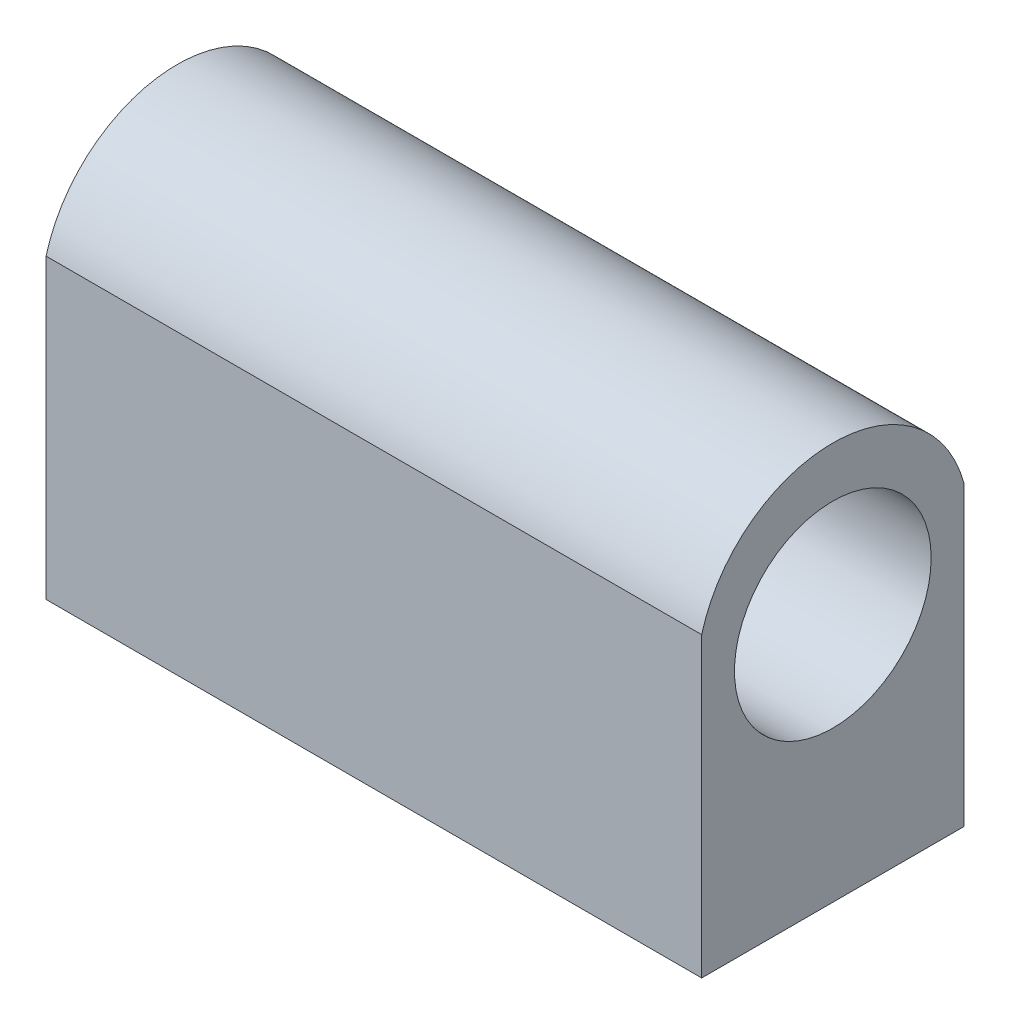
ISO-10303-21;
HEADER;
FILE_DESCRIPTION(('STEP AP214'),'2;1');
FILE_NAME('part.step','',(''),(''),'','','');
FILE_SCHEMA(('AUTOMOTIVE_DESIGN { 1 0 10303 214 1 1 1 1 }'));
ENDSEC;
DATA;
#1=APPLICATION_CONTEXT('core data for automotive mechanical design processes');
#2=APPLICATION_PROTOCOL_DEFINITION('international standard','automotive_design',2000,#1);
#3=PRODUCT_CONTEXT('',#1,'mechanical');
#4=PRODUCT('Part','Part','',(#3));
#5=PRODUCT_RELATED_PRODUCT_CATEGORY('part','',(#4));
#6=PRODUCT_DEFINITION_FORMATION('','',#4);
#7=PRODUCT_DEFINITION_CONTEXT('part definition',#1,'design');
#8=PRODUCT_DEFINITION('design','',#6,#7);
#9=PRODUCT_DEFINITION_SHAPE('','',#8);
#10=(LENGTH_UNIT() NAMED_UNIT(*) SI_UNIT(.MILLI.,.METRE.));
#11=(NAMED_UNIT(*) PLANE_ANGLE_UNIT() SI_UNIT($,.RADIAN.));
#12=(NAMED_UNIT(*) SI_UNIT($,.STERADIAN.) SOLID_ANGLE_UNIT());
#13=UNCERTAINTY_MEASURE_WITH_UNIT(LENGTH_MEASURE(1.E-05),#10,'distance_accuracy_value','');
#14=(GEOMETRIC_REPRESENTATION_CONTEXT(3) GLOBAL_UNCERTAINTY_ASSIGNED_CONTEXT((#13)) GLOBAL_UNIT_ASSIGNED_CONTEXT((#10,
#11,#12)) REPRESENTATION_CONTEXT('',''));
#15=CARTESIAN_POINT('',(0.,0.,0.));
#16=DIRECTION('',(0.,0.,1.));
#17=DIRECTION('',(1.,0.,0.));
#18=AXIS2_PLACEMENT_3D('',#15,#16,#17);
#19=CARTESIAN_POINT('',(-25.,44.,-10.));
#20=DIRECTION('',(1.,0.,0.));
#21=DIRECTION('',(0.,0.,-1.));
#22=AXIS2_PLACEMENT_3D('',#19,#20,#21);
#23=PLANE('',#22);
#24=CARTESIAN_POINT('',(-25.,19.,0.));
#25=DIRECTION('',(1.,0.,0.));
#26=DIRECTION('',(0.,0.,-1.));
#27=AXIS2_PLACEMENT_3D('',#24,#25,#26);
#28=CIRCLE('',#27,7.5);
#29=CARTESIAN_POINT('',(-25.,19.,-7.5));
#30=VERTEX_POINT('',#29);
#31=EDGE_CURVE('E104',#30,#30,#28,.T.);
#32=ORIENTED_EDGE('',*,*,#31,.T.);
#33=EDGE_LOOP('',(#32));
#34=FACE_BOUND('',#33,.T.);
#35=DIRECTION('',(0.,-1.,0.));
#36=VECTOR('',#35,1.);
#37=CARTESIAN_POINT('',(-25.,44.,10.));
#38=LINE('',#37,#36);
#39=CARTESIAN_POINT('',(-25.,22.6772892014343,10.));
#40=VERTEX_POINT('',#39);
#41=CARTESIAN_POINT('',(-25.,0.,10.));
#42=VERTEX_POINT('',#41);
#43=EDGE_CURVE('E11',#40,#42,#38,.T.);
#44=ORIENTED_EDGE('',*,*,#43,.F.);
#45=CARTESIAN_POINT('',(-25.,19.9812503850598,0.));
#46=DIRECTION('',(1.,0.,0.));
#47=DIRECTION('',(0.,0.,-1.));
#48=AXIS2_PLACEMENT_3D('',#45,#46,#47);
#49=CIRCLE('',#48,10.3570567874951);
#50=CARTESIAN_POINT('',(-25.,22.6772892014343,-10.));
#51=VERTEX_POINT('',#50);
#52=EDGE_CURVE('E77',#40,#51,#49,.F.);
#53=ORIENTED_EDGE('',*,*,#52,.T.);
#54=DIRECTION('',(0.,-1.,0.));
#55=VECTOR('',#54,1.);
#56=CARTESIAN_POINT('',(-25.,44.,-10.));
#57=LINE('',#56,#55);
#58=CARTESIAN_POINT('',(-25.,0.,-10.));
#59=VERTEX_POINT('',#58);
#60=EDGE_CURVE('E58',#51,#59,#57,.T.);
#61=ORIENTED_EDGE('',*,*,#60,.T.);
#62=DIRECTION('',(0.,0.,1.));
#63=VECTOR('',#62,1.);
#64=CARTESIAN_POINT('',(-25.,0.,-10.));
#65=LINE('',#64,#63);
#66=EDGE_CURVE('E102',#59,#42,#65,.T.);
#67=ORIENTED_EDGE('',*,*,#66,.T.);
#68=EDGE_LOOP('',(#44,#53,#61,#67));
#69=FACE_BOUND('',#68,.T.);
#70=ADVANCED_FACE('F36',(#34,#69),#23,.F.);
#71=CARTESIAN_POINT('',(25.,44.,-10.));
#72=DIRECTION('',(-1.,0.,0.));
#73=DIRECTION('',(0.,0.,1.));
#74=AXIS2_PLACEMENT_3D('',#71,#72,#73);
#75=PLANE('',#74);
#76=CARTESIAN_POINT('',(25.,19.,0.));
#77=DIRECTION('',(1.,0.,0.));
#78=DIRECTION('',(0.,0.,-1.));
#79=AXIS2_PLACEMENT_3D('',#76,#77,#78);
#80=CIRCLE('',#79,7.5);
#81=CARTESIAN_POINT('',(25.,19.,-7.5));
#82=VERTEX_POINT('',#81);
#83=EDGE_CURVE('E107',#82,#82,#80,.T.);
#84=ORIENTED_EDGE('',*,*,#83,.F.);
#85=EDGE_LOOP('',(#84));
#86=FACE_BOUND('',#85,.T.);
#87=DIRECTION('',(0.,-1.,0.));
#88=VECTOR('',#87,1.);
#89=CARTESIAN_POINT('',(25.,44.,-10.));
#90=LINE('',#89,#88);
#91=CARTESIAN_POINT('',(25.,22.6772892014343,-10.));
#92=VERTEX_POINT('',#91);
#93=CARTESIAN_POINT('',(25.,0.,-10.));
#94=VERTEX_POINT('',#93);
#95=EDGE_CURVE('E88',#92,#94,#90,.T.);
#96=ORIENTED_EDGE('',*,*,#95,.F.);
#97=CARTESIAN_POINT('',(25.,19.9812503850598,0.));
#98=DIRECTION('',(1.,0.,0.));
#99=DIRECTION('',(0.,0.,-1.));
#100=AXIS2_PLACEMENT_3D('',#97,#98,#99);
#101=CIRCLE('',#100,10.3570567874951);
#102=CARTESIAN_POINT('',(25.,22.6772892014343,10.));
#103=VERTEX_POINT('',#102);
#104=EDGE_CURVE('E50',#103,#92,#101,.F.);
#105=ORIENTED_EDGE('',*,*,#104,.F.);
#106=DIRECTION('',(0.,-1.,0.));
#107=VECTOR('',#106,1.);
#108=CARTESIAN_POINT('',(25.,44.,10.));
#109=LINE('',#108,#107);
#110=CARTESIAN_POINT('',(25.,0.,10.));
#111=VERTEX_POINT('',#110);
#112=EDGE_CURVE('E43',#103,#111,#109,.T.);
#113=ORIENTED_EDGE('',*,*,#112,.T.);
#114=DIRECTION('',(0.,0.,-1.));
#115=VECTOR('',#114,1.);
#116=CARTESIAN_POINT('',(25.,0.,-10.));
#117=LINE('',#116,#115);
#118=EDGE_CURVE('E99',#111,#94,#117,.T.);
#119=ORIENTED_EDGE('',*,*,#118,.T.);
#120=EDGE_LOOP('',(#96,#105,#113,#119));
#121=FACE_BOUND('',#120,.T.);
#122=ADVANCED_FACE('F85',(#86,#121),#75,.F.);
#123=CARTESIAN_POINT('',(-25.,44.,10.));
#124=DIRECTION('',(0.,0.,-1.));
#125=DIRECTION('',(-1.,0.,0.));
#126=AXIS2_PLACEMENT_3D('',#123,#124,#125);
#127=PLANE('',#126);
#128=ORIENTED_EDGE('',*,*,#112,.F.);
#129=DIRECTION('',(1.,0.,0.));
#130=VECTOR('',#129,1.);
#131=CARTESIAN_POINT('',(-25.,22.6772892014343,10.));
#132=LINE('',#131,#130);
#133=EDGE_CURVE('E75',#40,#103,#132,.T.);
#134=ORIENTED_EDGE('',*,*,#133,.F.);
#135=ORIENTED_EDGE('',*,*,#43,.T.);
#136=DIRECTION('',(1.,0.,0.));
#137=VECTOR('',#136,1.);
#138=CARTESIAN_POINT('',(-25.,0.,10.));
#139=LINE('',#138,#137);
#140=EDGE_CURVE('E92',#42,#111,#139,.T.);
#141=ORIENTED_EDGE('',*,*,#140,.T.);
#142=EDGE_LOOP('',(#128,#134,#135,#141));
#143=FACE_BOUND('',#142,.T.);
#144=ADVANCED_FACE('F90',(#143),#127,.F.);
#145=CARTESIAN_POINT('',(-25.,44.,-10.));
#146=DIRECTION('',(0.,0.,1.));
#147=DIRECTION('',(1.,0.,0.));
#148=AXIS2_PLACEMENT_3D('',#145,#146,#147);
#149=PLANE('',#148);
#150=ORIENTED_EDGE('',*,*,#60,.F.);
#151=DIRECTION('',(1.,0.,0.));
#152=VECTOR('',#151,1.);
#153=CARTESIAN_POINT('',(-25.,22.6772892014343,-10.));
#154=LINE('',#153,#152);
#155=EDGE_CURVE('E81',#51,#92,#154,.T.);
#156=ORIENTED_EDGE('',*,*,#155,.T.);
#157=ORIENTED_EDGE('',*,*,#95,.T.);
#158=DIRECTION('',(-1.,0.,0.));
#159=VECTOR('',#158,1.);
#160=CARTESIAN_POINT('',(-25.,0.,-10.));
#161=LINE('',#160,#159);
#162=EDGE_CURVE('E97',#94,#59,#161,.T.);
#163=ORIENTED_EDGE('',*,*,#162,.T.);
#164=EDGE_LOOP('',(#150,#156,#157,#163));
#165=FACE_BOUND('',#164,.T.);
#166=ADVANCED_FACE('F112',(#165),#149,.F.);
#167=CARTESIAN_POINT('',(0.,0.,0.));
#168=DIRECTION('',(0.,1.,0.));
#169=DIRECTION('',(0.,0.,1.));
#170=AXIS2_PLACEMENT_3D('',#167,#168,#169);
#171=PLANE('',#170);
#172=ORIENTED_EDGE('',*,*,#66,.F.);
#173=ORIENTED_EDGE('',*,*,#162,.F.);
#174=ORIENTED_EDGE('',*,*,#118,.F.);
#175=ORIENTED_EDGE('',*,*,#140,.F.);
#176=EDGE_LOOP('',(#172,#173,#174,#175));
#177=FACE_BOUND('',#176,.T.);
#178=ADVANCED_FACE('F116',(#177),#171,.F.);
#179=CARTESIAN_POINT('',(-25.,19.,0.));
#180=DIRECTION('',(1.,0.,0.));
#181=DIRECTION('',(0.,0.,-1.));
#182=AXIS2_PLACEMENT_3D('',#179,#180,#181);
#183=CYLINDRICAL_SURFACE('',#182,7.5);
#184=ORIENTED_EDGE('',*,*,#31,.F.);
#185=EDGE_LOOP('',(#184));
#186=FACE_BOUND('',#185,.T.);
#187=ORIENTED_EDGE('',*,*,#83,.T.);
#188=EDGE_LOOP('',(#187));
#189=FACE_BOUND('',#188,.T.);
#190=ADVANCED_FACE('F118',(#186,#189),#183,.F.);
#191=CARTESIAN_POINT('',(-25.,19.9812503850598,0.));
#192=DIRECTION('',(1.,0.,0.));
#193=DIRECTION('',(0.,0.,-1.));
#194=AXIS2_PLACEMENT_3D('',#191,#192,#193);
#195=CYLINDRICAL_SURFACE('',#194,10.3570567874951);
#196=ORIENTED_EDGE('',*,*,#155,.F.);
#197=ORIENTED_EDGE('',*,*,#52,.F.);
#198=ORIENTED_EDGE('',*,*,#133,.T.);
#199=ORIENTED_EDGE('',*,*,#104,.T.);
#200=EDGE_LOOP('',(#196,#197,#198,#199));
#201=FACE_BOUND('',#200,.T.);
#202=ADVANCED_FACE('F76',(#201),#195,.T.);
#203=CLOSED_SHELL('',(#70,#122,#144,#166,#178,#190,#202));
#204=MANIFOLD_SOLID_BREP('B2',#203);
#205=ADVANCED_BREP_SHAPE_REPRESENTATION('',(#18,#204),#14);
#206=SHAPE_DEFINITION_REPRESENTATION(#9,#205);
ENDSEC;
END-ISO-10303-21;
